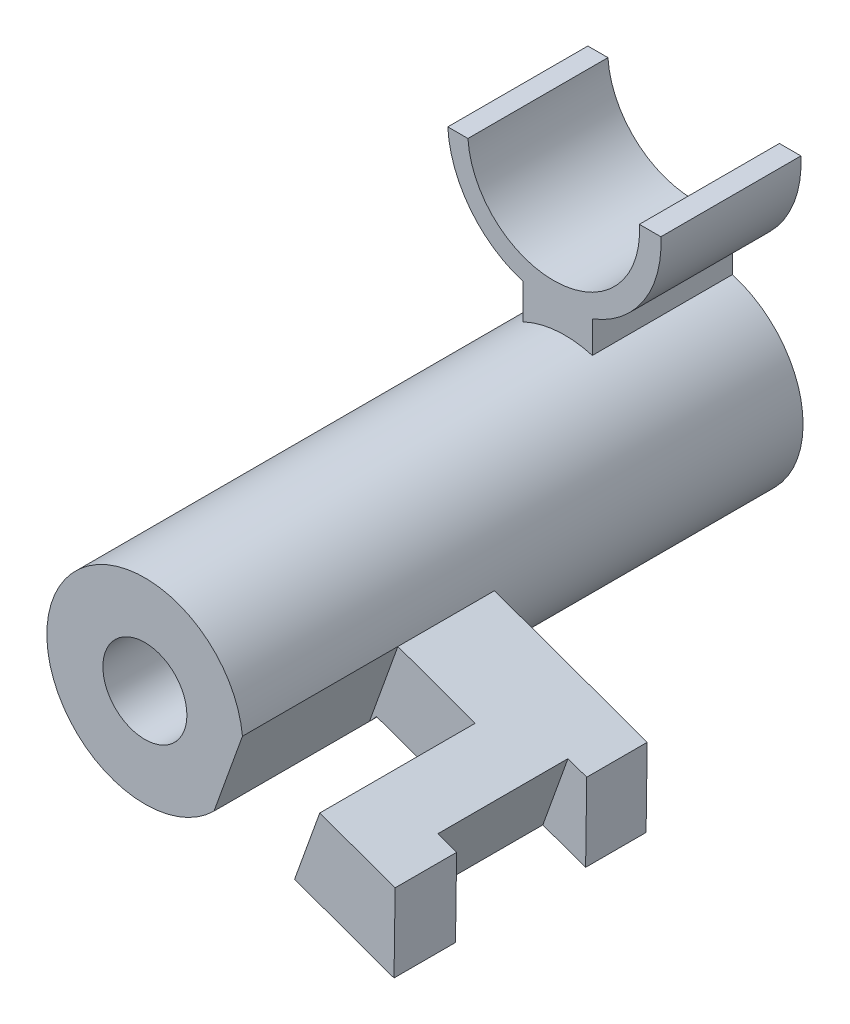
ISO-10303-21;
HEADER;
FILE_DESCRIPTION(('STEP AP214'),'2;1');
FILE_NAME('part.step','',(''),(''),'','','');
FILE_SCHEMA(('AUTOMOTIVE_DESIGN { 1 0 10303 214 1 1 1 1 }'));
ENDSEC;
DATA;
#1=APPLICATION_CONTEXT('core data for automotive mechanical design processes');
#2=APPLICATION_PROTOCOL_DEFINITION('international standard','automotive_design',2000,#1);
#3=PRODUCT_CONTEXT('',#1,'mechanical');
#4=PRODUCT('Part','Part','',(#3));
#5=PRODUCT_RELATED_PRODUCT_CATEGORY('part','',(#4));
#6=PRODUCT_DEFINITION_FORMATION('','',#4);
#7=PRODUCT_DEFINITION_CONTEXT('part definition',#1,'design');
#8=PRODUCT_DEFINITION('design','',#6,#7);
#9=PRODUCT_DEFINITION_SHAPE('','',#8);
#10=(LENGTH_UNIT() NAMED_UNIT(*) SI_UNIT(.MILLI.,.METRE.));
#11=(NAMED_UNIT(*) PLANE_ANGLE_UNIT() SI_UNIT($,.RADIAN.));
#12=(NAMED_UNIT(*) SI_UNIT($,.STERADIAN.) SOLID_ANGLE_UNIT());
#13=UNCERTAINTY_MEASURE_WITH_UNIT(LENGTH_MEASURE(1.E-05),#10,'distance_accuracy_value','');
#14=(GEOMETRIC_REPRESENTATION_CONTEXT(3) GLOBAL_UNCERTAINTY_ASSIGNED_CONTEXT((#13)) GLOBAL_UNIT_ASSIGNED_CONTEXT((#10,
#11,#12)) REPRESENTATION_CONTEXT('',''));
#15=CARTESIAN_POINT('',(0.,0.,0.));
#16=DIRECTION('',(0.,0.,1.));
#17=DIRECTION('',(1.,0.,0.));
#18=AXIS2_PLACEMENT_3D('',#15,#16,#17);
#19=CARTESIAN_POINT('',(-29.1148266125845,50.9476848886692,-100.));
#20=DIRECTION('',(0.,0.,1.));
#21=DIRECTION('',(1.,0.,0.));
#22=AXIS2_PLACEMENT_3D('',#19,#20,#21);
#23=CYLINDRICAL_SURFACE('',#22,17.5);
#24=DIRECTION('',(0.,0.,1.));
#25=VECTOR('',#24,1.);
#26=CARTESIAN_POINT('',(-16.775176631666,38.5386946659146,-100.));
#27=LINE('',#26,#25);
#28=CARTESIAN_POINT('',(-16.775176631666,38.5386946659146,0.));
#29=VERTEX_POINT('',#28);
#30=CARTESIAN_POINT('',(-16.775176631666,38.5386946659146,-27.7524799411566));
#31=VERTEX_POINT('',#30);
#32=EDGE_CURVE('E273',#29,#31,#27,.F.);
#33=ORIENTED_EDGE('',*,*,#32,.F.);
#34=CARTESIAN_POINT('',(-29.1148266125845,50.9476848886692,0.));
#35=DIRECTION('',(0.,0.,1.));
#36=DIRECTION('',(1.,0.,0.));
#37=AXIS2_PLACEMENT_3D('',#34,#35,#36);
#38=CIRCLE('',#37,17.5);
#39=CARTESIAN_POINT('',(-11.6981486491467,52.6533603319769,0.));
#40=VERTEX_POINT('',#39);
#41=EDGE_CURVE('E311',#40,#29,#38,.T.);
#42=ORIENTED_EDGE('',*,*,#41,.F.);
#43=DIRECTION('',(0.,0.,1.));
#44=VECTOR('',#43,1.);
#45=CARTESIAN_POINT('',(-11.6981486491467,52.6533603319769,0.));
#46=LINE('',#45,#44);
#47=CARTESIAN_POINT('',(-11.6981486491467,52.6533603319769,-27.7524799411566));
#48=VERTEX_POINT('',#47);
#49=EDGE_CURVE('E250',#48,#40,#46,.T.);
#50=ORIENTED_EDGE('',*,*,#49,.F.);
#51=DIRECTION('',(0.,0.,1.));
#52=VECTOR('',#51,1.);
#53=CARTESIAN_POINT('',(-11.6981486491467,52.6533603319769,-45.));
#54=LINE('',#53,#52);
#55=CARTESIAN_POINT('',(-11.6981486491467,52.6533603319769,-45.));
#56=VERTEX_POINT('',#55);
#57=EDGE_CURVE('E302',#56,#48,#54,.T.);
#58=ORIENTED_EDGE('',*,*,#57,.F.);
#59=CARTESIAN_POINT('',(-29.1148266125845,50.9476848886692,-45.));
#60=DIRECTION('',(0.,0.,1.));
#61=DIRECTION('',(1.,0.,0.));
#62=AXIS2_PLACEMENT_3D('',#59,#60,#61);
#63=CIRCLE('',#62,17.5);
#64=CARTESIAN_POINT('',(-15.5292414598357,39.9167340657612,-45.));
#65=VERTEX_POINT('',#64);
#66=EDGE_CURVE('E42',#56,#65,#63,.F.);
#67=ORIENTED_EDGE('',*,*,#66,.T.);
#68=DIRECTION('',(0.,0.,1.));
#69=VECTOR('',#68,1.);
#70=CARTESIAN_POINT('',(-15.5292414598357,39.9167340657612,-45.));
#71=LINE('',#70,#69);
#72=CARTESIAN_POINT('',(-15.5292414598357,39.9167340657612,-27.7524799411566));
#73=VERTEX_POINT('',#72);
#74=EDGE_CURVE('E299',#65,#73,#71,.T.);
#75=ORIENTED_EDGE('',*,*,#74,.T.);
#76=CARTESIAN_POINT('',(-29.1148266125845,50.9476848886692,-27.7524799411566));
#77=DIRECTION('',(0.,0.,-1.));
#78=DIRECTION('',(-1.,0.,0.));
#79=AXIS2_PLACEMENT_3D('',#76,#77,#78);
#80=CIRCLE('',#79,17.5);
#81=EDGE_CURVE('E271',#31,#73,#80,.F.);
#82=ORIENTED_EDGE('',*,*,#81,.F.);
#83=EDGE_LOOP('',(#33,#42,#50,#58,#67,#75,#82));
#84=FACE_BOUND('',#83,.T.);
#85=CARTESIAN_POINT('',(-29.1148266125845,50.9476848886692,-75.));
#86=DIRECTION('',(0.,0.,-1.));
#87=DIRECTION('',(-1.,0.,0.));
#88=AXIS2_PLACEMENT_3D('',#85,#86,#87);
#89=CIRCLE('',#88,17.5);
#90=CARTESIAN_POINT('',(-36.589403127859,66.7711075878612,-75.));
#91=VERTEX_POINT('',#90);
#92=CARTESIAN_POINT('',(-24.2356590013951,67.753746992027,-75.));
#93=VERTEX_POINT('',#92);
#94=EDGE_CURVE('E49',#91,#93,#89,.T.);
#95=ORIENTED_EDGE('',*,*,#94,.F.);
#96=DIRECTION('',(0.,0.,-1.));
#97=VECTOR('',#96,1.);
#98=CARTESIAN_POINT('',(-36.589403127859,66.7711075878612,-75.));
#99=LINE('',#98,#97);
#100=CARTESIAN_POINT('',(-36.589403127859,66.7711075878612,-100.));
#101=VERTEX_POINT('',#100);
#102=EDGE_CURVE('E226',#91,#101,#99,.T.);
#103=ORIENTED_EDGE('',*,*,#102,.T.);
#104=CARTESIAN_POINT('',(-29.1148266125845,50.9476848886692,-100.));
#105=DIRECTION('',(0.,0.,1.));
#106=DIRECTION('',(1.,0.,0.));
#107=AXIS2_PLACEMENT_3D('',#104,#105,#106);
#108=CIRCLE('',#107,17.5);
#109=CARTESIAN_POINT('',(-24.2356590013951,67.753746992027,-100.));
#110=VERTEX_POINT('',#109);
#111=EDGE_CURVE('E314',#101,#110,#108,.T.);
#112=ORIENTED_EDGE('',*,*,#111,.T.);
#113=DIRECTION('',(0.,0.,-1.));
#114=VECTOR('',#113,1.);
#115=CARTESIAN_POINT('',(-24.2356590013951,67.753746992027,-75.));
#116=LINE('',#115,#114);
#117=EDGE_CURVE('E54',#93,#110,#116,.T.);
#118=ORIENTED_EDGE('',*,*,#117,.F.);
#119=EDGE_LOOP('',(#95,#103,#112,#118));
#120=FACE_BOUND('',#119,.T.);
#121=ADVANCED_FACE('F35',(#84,#120),#23,.T.);
#122=CARTESIAN_POINT('',(15.5591041955267,42.8489598103443,-45.));
#123=DIRECTION('',(0.999899341143809,-0.0141882902485532,0.));
#124=DIRECTION('',(0.0141882902485532,0.999899341143809,0.));
#125=AXIS2_PLACEMENT_3D('',#122,#123,#124);
#126=PLANE('',#125);
#127=DIRECTION('',(0.0141882902485532,0.999899341143809,0.));
#128=VECTOR('',#127,1.);
#129=CARTESIAN_POINT('',(15.5591041955267,42.8489598103443,-34.2038472972816));
#130=LINE('',#129,#128);
#131=CARTESIAN_POINT('',(15.359838120935,28.8059699076763,-34.2038472972816));
#132=VERTEX_POINT('',#131);
#133=CARTESIAN_POINT('',(15.5591041955267,42.8489598103444,-34.2038472972816));
#134=VERTEX_POINT('',#133);
#135=EDGE_CURVE('E246',#132,#134,#130,.T.);
#136=ORIENTED_EDGE('',*,*,#135,.F.);
#137=DIRECTION('',(0.,0.,1.));
#138=VECTOR('',#137,1.);
#139=CARTESIAN_POINT('',(15.359838120935,28.8059699076762,-45.));
#140=LINE('',#139,#138);
#141=CARTESIAN_POINT('',(15.359838120935,28.8059699076762,-45.));
#142=VERTEX_POINT('',#141);
#143=EDGE_CURVE('E294',#142,#132,#140,.T.);
#144=ORIENTED_EDGE('',*,*,#143,.F.);
#145=DIRECTION('',(0.0141882902485532,0.999899341143809,0.));
#146=VECTOR('',#145,1.);
#147=CARTESIAN_POINT('',(15.5591041955267,42.8489598103443,-45.));
#148=LINE('',#147,#146);
#149=CARTESIAN_POINT('',(15.5591041955267,42.8489598103443,-45.));
#150=VERTEX_POINT('',#149);
#151=EDGE_CURVE('E276',#142,#150,#148,.T.);
#152=ORIENTED_EDGE('',*,*,#151,.T.);
#153=DIRECTION('',(0.,0.,1.));
#154=VECTOR('',#153,1.);
#155=CARTESIAN_POINT('',(15.5591041955267,42.8489598103443,-45.));
#156=LINE('',#155,#154);
#157=EDGE_CURVE('E305',#150,#134,#156,.T.);
#158=ORIENTED_EDGE('',*,*,#157,.T.);
#159=EDGE_LOOP('',(#136,#144,#152,#158));
#160=FACE_BOUND('',#159,.T.);
#161=ADVANCED_FACE('F335',(#160),#126,.T.);
#162=CARTESIAN_POINT('',(-29.1148266125845,50.9476848886692,0.));
#163=DIRECTION('',(0.,0.,1.));
#164=DIRECTION('',(1.,0.,0.));
#165=AXIS2_PLACEMENT_3D('',#162,#163,#164);
#166=PLANE('',#165);
#167=DIRECTION('',(0.33846853216795,0.940977711070817,0.));
#168=VECTOR('',#167,1.);
#169=CARTESIAN_POINT('',(-26.9292325967045,10.3093633337902,0.));
#170=LINE('',#169,#168);
#171=EDGE_CURVE('E258',#29,#40,#170,.T.);
#172=ORIENTED_EDGE('',*,*,#171,.T.);
#173=ORIENTED_EDGE('',*,*,#41,.T.);
#174=EDGE_LOOP('',(#172,#173));
#175=FACE_BOUND('',#174,.T.);
#176=CARTESIAN_POINT('',(-29.1148266125845,50.9476848886692,0.));
#177=DIRECTION('',(0.,0.,1.));
#178=DIRECTION('',(1.,0.,0.));
#179=AXIS2_PLACEMENT_3D('',#176,#177,#178);
#180=CIRCLE('',#179,7.5);
#181=CARTESIAN_POINT('',(-21.6148266125845,50.9476848886692,0.));
#182=VERTEX_POINT('',#181);
#183=EDGE_CURVE('E297',#182,#182,#180,.T.);
#184=ORIENTED_EDGE('',*,*,#183,.F.);
#185=EDGE_LOOP('',(#184));
#186=FACE_BOUND('',#185,.T.);
#187=ADVANCED_FACE('F355',(#175,#186),#166,.T.);
#188=CARTESIAN_POINT('',(-29.1148266125845,50.9476848886692,-100.));
#189=DIRECTION('',(0.,0.,1.));
#190=DIRECTION('',(1.,0.,0.));
#191=AXIS2_PLACEMENT_3D('',#188,#189,#190);
#192=PLANE('',#191);
#193=CARTESIAN_POINT('',(-29.1148266125845,50.9476848886692,-100.));
#194=DIRECTION('',(0.,0.,1.));
#195=DIRECTION('',(1.,0.,0.));
#196=AXIS2_PLACEMENT_3D('',#193,#194,#195);
#197=CIRCLE('',#196,7.5);
#198=CARTESIAN_POINT('',(-21.6148266125845,50.9476848886692,-100.));
#199=VERTEX_POINT('',#198);
#200=EDGE_CURVE('E308',#199,#199,#197,.T.);
#201=ORIENTED_EDGE('',*,*,#200,.T.);
#202=EDGE_LOOP('',(#201));
#203=FACE_BOUND('',#202,.T.);
#204=ORIENTED_EDGE('',*,*,#111,.F.);
#205=DIRECTION('',(0.,-1.,0.));
#206=VECTOR('',#205,1.);
#207=CARTESIAN_POINT('',(-36.589403127859,0.,-100.));
#208=LINE('',#207,#206);
#209=CARTESIAN_POINT('',(-36.589403127859,72.9987783409454,-100.));
#210=VERTEX_POINT('',#209);
#211=EDGE_CURVE('E217',#210,#101,#208,.T.);
#212=ORIENTED_EDGE('',*,*,#211,.F.);
#213=CARTESIAN_POINT('',(-31.0187177659695,91.2116636441969,-100.));
#214=DIRECTION('',(0.,0.,-1.));
#215=DIRECTION('',(-1.,0.,0.));
#216=AXIS2_PLACEMENT_3D('',#213,#214,#215);
#217=CIRCLE('',#216,19.0457797548581);
#218=CARTESIAN_POINT('',(-50.0374355319391,90.1967247253656,-100.));
#219=VERTEX_POINT('',#218);
#220=EDGE_CURVE('E196',#210,#219,#217,.T.);
#221=ORIENTED_EDGE('',*,*,#220,.T.);
#222=DIRECTION('',(-1.,0.,0.));
#223=VECTOR('',#222,1.);
#224=CARTESIAN_POINT('',(0.,90.1967247253656,-100.));
#225=LINE('',#224,#223);
#226=CARTESIAN_POINT('',(-46.4461132037667,90.1967247253656,-100.));
#227=VERTEX_POINT('',#226);
#228=EDGE_CURVE('E193',#227,#219,#225,.T.);
#229=ORIENTED_EDGE('',*,*,#228,.F.);
#230=CARTESIAN_POINT('',(-31.1439571967711,91.2116636441969,-100.));
#231=DIRECTION('',(0.,0.,-1.));
#232=DIRECTION('',(-1.,0.,0.));
#233=AXIS2_PLACEMENT_3D('',#230,#231,#232);
#234=CIRCLE('',#233,15.3357777589332);
#235=CARTESIAN_POINT('',(-15.8418011897754,92.2266025630283,-100.));
#236=VERTEX_POINT('',#235);
#237=EDGE_CURVE('E208',#236,#227,#234,.T.);
#238=ORIENTED_EDGE('',*,*,#237,.F.);
#239=DIRECTION('',(-1.,0.,0.));
#240=VECTOR('',#239,1.);
#241=CARTESIAN_POINT('',(0.,92.2266025630283,-100.));
#242=LINE('',#241,#240);
#243=CARTESIAN_POINT('',(-12.,92.2266025630283,-100.));
#244=VERTEX_POINT('',#243);
#245=EDGE_CURVE('E183',#244,#236,#242,.T.);
#246=ORIENTED_EDGE('',*,*,#245,.F.);
#247=CARTESIAN_POINT('',(-24.2356590013951,73.4147020982786,-100.));
#248=VERTEX_POINT('',#247);
#249=EDGE_CURVE('E211',#244,#248,#217,.T.);
#250=ORIENTED_EDGE('',*,*,#249,.T.);
#251=DIRECTION('',(0.,-1.,0.));
#252=VECTOR('',#251,1.);
#253=CARTESIAN_POINT('',(-24.2356590013951,0.,-100.));
#254=LINE('',#253,#252);
#255=EDGE_CURVE('E214',#248,#110,#254,.T.);
#256=ORIENTED_EDGE('',*,*,#255,.T.);
#257=EDGE_LOOP('',(#204,#212,#221,#229,#238,#246,#250,#256));
#258=FACE_BOUND('',#257,.T.);
#259=ADVANCED_FACE('F358',(#203,#258),#192,.F.);
#260=DIRECTION('',(0.33846853216795,0.940977711070817,0.));
#261=VECTOR('',#260,1.);
#262=CARTESIAN_POINT('',(-13.1276764989206,5.3449604801513,0.));
#263=LINE('',#262,#261);
#264=CARTESIAN_POINT('',(-2.39199139889896,35.1912812813499,0.));
#265=VERTEX_POINT('',#264);
#266=CARTESIAN_POINT('',(2.10340744863714,47.688957478338,0.));
#267=VERTEX_POINT('',#266);
#268=EDGE_CURVE('E264',#265,#267,#263,.T.);
#269=ORIENTED_EDGE('',*,*,#268,.F.);
#270=DIRECTION('',(0.940977711070817,-0.33846853216795,0.));
#271=VECTOR('',#270,1.);
#272=CARTESIAN_POINT('',(-15.5292414598357,39.9167340657612,0.));
#273=LINE('',#272,#271);
#274=CARTESIAN_POINT('',(15.359838120935,28.8059699076762,0.));
#275=VERTEX_POINT('',#274);
#276=EDGE_CURVE('E280',#265,#275,#273,.T.);
#277=ORIENTED_EDGE('',*,*,#276,.T.);
#278=DIRECTION('',(0.0141882902485532,0.999899341143809,0.));
#279=VECTOR('',#278,1.);
#280=CARTESIAN_POINT('',(15.5591041955267,42.8489598103443,0.));
#281=LINE('',#280,#279);
#282=CARTESIAN_POINT('',(15.5591041955267,42.8489598103443,0.));
#283=VERTEX_POINT('',#282);
#284=EDGE_CURVE('E275',#275,#283,#281,.T.);
#285=ORIENTED_EDGE('',*,*,#284,.T.);
#286=DIRECTION('',(-0.940977711070817,0.33846853216795,0.));
#287=VECTOR('',#286,1.);
#288=CARTESIAN_POINT('',(-11.6981486491467,52.6533603319769,0.));
#289=LINE('',#288,#287);
#290=EDGE_CURVE('E289',#283,#267,#289,.T.);
#291=ORIENTED_EDGE('',*,*,#290,.T.);
#292=EDGE_LOOP('',(#269,#277,#285,#291));
#293=FACE_BOUND('',#292,.T.);
#294=ADVANCED_FACE('F359',(#293),#166,.T.);
#295=CARTESIAN_POINT('',(-29.1148266125845,50.9476848886692,-100.));
#296=DIRECTION('',(0.,0.,1.));
#297=DIRECTION('',(1.,0.,0.));
#298=AXIS2_PLACEMENT_3D('',#295,#296,#297);
#299=CYLINDRICAL_SURFACE('',#298,7.5);
#300=ORIENTED_EDGE('',*,*,#200,.F.);
#301=EDGE_LOOP('',(#300));
#302=FACE_BOUND('',#301,.T.);
#303=ORIENTED_EDGE('',*,*,#183,.T.);
#304=EDGE_LOOP('',(#303));
#305=FACE_BOUND('',#304,.T.);
#306=ADVANCED_FACE('F362',(#302,#305),#299,.F.);
#307=DIRECTION('',(-0.0141882902485532,-0.999899341143809,0.));
#308=VECTOR('',#307,1.);
#309=CARTESIAN_POINT('',(15.5591041955267,42.8489598103443,-10.9758652624466));
#310=LINE('',#309,#308);
#311=CARTESIAN_POINT('',(15.5591041955267,42.8489598103444,-10.9758652624466));
#312=VERTEX_POINT('',#311);
#313=CARTESIAN_POINT('',(15.359838120935,28.8059699076763,-10.9758652624466));
#314=VERTEX_POINT('',#313);
#315=EDGE_CURVE('E242',#312,#314,#310,.T.);
#316=ORIENTED_EDGE('',*,*,#315,.F.);
#317=EDGE_CURVE('E286',#312,#283,#156,.T.);
#318=ORIENTED_EDGE('',*,*,#317,.T.);
#319=ORIENTED_EDGE('',*,*,#284,.F.);
#320=EDGE_CURVE('E298',#314,#275,#140,.T.);
#321=ORIENTED_EDGE('',*,*,#320,.F.);
#322=EDGE_LOOP('',(#316,#318,#319,#321));
#323=FACE_BOUND('',#322,.T.);
#324=ADVANCED_FACE('F364',(#323),#126,.T.);
#325=CARTESIAN_POINT('',(-15.5292414598357,39.9167340657612,-45.));
#326=DIRECTION('',(-0.33846853216795,-0.940977711070817,0.));
#327=DIRECTION('',(0.940977711070817,-0.33846853216795,0.));
#328=AXIS2_PLACEMENT_3D('',#325,#326,#327);
#329=PLANE('',#328);
#330=DIRECTION('',(0.940977711070817,-0.33846853216795,0.));
#331=VECTOR('',#330,1.);
#332=CARTESIAN_POINT('',(-15.5292414598357,39.9167340657612,-34.2038472972816));
#333=LINE('',#332,#331);
#334=CARTESIAN_POINT('',(7.72160650784135,31.5534324798775,-34.2038472972816));
#335=VERTEX_POINT('',#334);
#336=EDGE_CURVE('E244',#335,#132,#333,.T.);
#337=ORIENTED_EDGE('',*,*,#336,.F.);
#338=DIRECTION('',(0.,0.,-1.));
#339=VECTOR('',#338,1.);
#340=CARTESIAN_POINT('',(7.72160650784134,31.5534324798775,-45.));
#341=LINE('',#340,#339);
#342=CARTESIAN_POINT('',(7.72160650784135,31.5534324798775,-10.9758652624466));
#343=VERTEX_POINT('',#342);
#344=EDGE_CURVE('E248',#343,#335,#341,.T.);
#345=ORIENTED_EDGE('',*,*,#344,.F.);
#346=DIRECTION('',(-0.940977711070817,0.33846853216795,0.));
#347=VECTOR('',#346,1.);
#348=CARTESIAN_POINT('',(-15.5292414598357,39.9167340657612,-10.9758652624466));
#349=LINE('',#348,#347);
#350=EDGE_CURVE('E238',#314,#343,#349,.T.);
#351=ORIENTED_EDGE('',*,*,#350,.F.);
#352=ORIENTED_EDGE('',*,*,#320,.T.);
#353=ORIENTED_EDGE('',*,*,#276,.F.);
#354=DIRECTION('',(0.,0.,1.));
#355=VECTOR('',#354,1.);
#356=CARTESIAN_POINT('',(-2.39199139889896,35.1912812813499,-45.));
#357=LINE('',#356,#355);
#358=CARTESIAN_POINT('',(-2.39199139889896,35.1912812813499,-27.7524799411566));
#359=VERTEX_POINT('',#358);
#360=EDGE_CURVE('E261',#359,#265,#357,.T.);
#361=ORIENTED_EDGE('',*,*,#360,.F.);
#362=DIRECTION('',(0.940977711070817,-0.33846853216795,0.));
#363=VECTOR('',#362,1.);
#364=CARTESIAN_POINT('',(-15.5292414598357,39.9167340657612,-27.7524799411566));
#365=LINE('',#364,#363);
#366=EDGE_CURVE('E269',#73,#359,#365,.T.);
#367=ORIENTED_EDGE('',*,*,#366,.F.);
#368=ORIENTED_EDGE('',*,*,#74,.F.);
#369=DIRECTION('',(0.940977711070817,-0.33846853216795,0.));
#370=VECTOR('',#369,1.);
#371=CARTESIAN_POINT('',(-15.5292414598357,39.9167340657612,-45.));
#372=LINE('',#371,#370);
#373=EDGE_CURVE('E283',#65,#142,#372,.T.);
#374=ORIENTED_EDGE('',*,*,#373,.T.);
#375=ORIENTED_EDGE('',*,*,#143,.T.);
#376=EDGE_LOOP('',(#337,#345,#351,#352,#353,#361,#367,#368,#374,#375));
#377=FACE_BOUND('',#376,.T.);
#378=ADVANCED_FACE('F338',(#377),#329,.T.);
#379=CARTESIAN_POINT('',(-11.6981486491467,52.6533603319769,-45.));
#380=DIRECTION('',(0.33846853216795,0.940977711070817,0.));
#381=DIRECTION('',(-0.940977711070817,0.33846853216795,0.));
#382=AXIS2_PLACEMENT_3D('',#379,#380,#381);
#383=PLANE('',#382);
#384=DIRECTION('',(-0.940977711070817,0.33846853216795,0.));
#385=VECTOR('',#384,1.);
#386=CARTESIAN_POINT('',(-11.6981486491467,52.6533603319769,-34.2038472972816));
#387=LINE('',#386,#385);
#388=CARTESIAN_POINT('',(12.2170053553774,44.0511086768656,-34.2038472972816));
#389=VERTEX_POINT('',#388);
#390=EDGE_CURVE('E11',#134,#389,#387,.T.);
#391=ORIENTED_EDGE('',*,*,#390,.F.);
#392=ORIENTED_EDGE('',*,*,#157,.F.);
#393=DIRECTION('',(-0.940977711070817,0.33846853216795,0.));
#394=VECTOR('',#393,1.);
#395=CARTESIAN_POINT('',(-11.6981486491467,52.6533603319769,-45.));
#396=LINE('',#395,#394);
#397=EDGE_CURVE('E279',#150,#56,#396,.T.);
#398=ORIENTED_EDGE('',*,*,#397,.T.);
#399=ORIENTED_EDGE('',*,*,#57,.T.);
#400=DIRECTION('',(-0.940977711070817,0.33846853216795,0.));
#401=VECTOR('',#400,1.);
#402=CARTESIAN_POINT('',(-11.6981486491467,52.6533603319769,-27.7524799411566));
#403=LINE('',#402,#401);
#404=CARTESIAN_POINT('',(2.10340744863714,47.688957478338,-27.7524799411566));
#405=VERTEX_POINT('',#404);
#406=EDGE_CURVE('E255',#405,#48,#403,.T.);
#407=ORIENTED_EDGE('',*,*,#406,.F.);
#408=DIRECTION('',(0.,0.,-1.));
#409=VECTOR('',#408,1.);
#410=CARTESIAN_POINT('',(2.10340744863714,47.688957478338,0.));
#411=LINE('',#410,#409);
#412=EDGE_CURVE('E252',#267,#405,#411,.T.);
#413=ORIENTED_EDGE('',*,*,#412,.F.);
#414=ORIENTED_EDGE('',*,*,#290,.F.);
#415=ORIENTED_EDGE('',*,*,#317,.F.);
#416=DIRECTION('',(0.940977711070817,-0.33846853216795,0.));
#417=VECTOR('',#416,1.);
#418=CARTESIAN_POINT('',(12.2170053553774,44.0511086768656,-10.9758652624466));
#419=LINE('',#418,#417);
#420=CARTESIAN_POINT('',(12.2170053553773,44.0511086768656,-10.9758652624466));
#421=VERTEX_POINT('',#420);
#422=EDGE_CURVE('E233',#421,#312,#419,.T.);
#423=ORIENTED_EDGE('',*,*,#422,.F.);
#424=DIRECTION('',(0.,0.,1.));
#425=VECTOR('',#424,1.);
#426=CARTESIAN_POINT('',(12.2170053553774,44.0511086768656,-10.9758652624466));
#427=LINE('',#426,#425);
#428=EDGE_CURVE('E221',#389,#421,#427,.T.);
#429=ORIENTED_EDGE('',*,*,#428,.F.);
#430=EDGE_LOOP('',(#391,#392,#398,#399,#407,#413,#414,#415,#423,#429));
#431=FACE_BOUND('',#430,.T.);
#432=ADVANCED_FACE('F330',(#431),#383,.T.);
#433=CARTESIAN_POINT('',(0.,0.,-45.));
#434=DIRECTION('',(0.,0.,1.));
#435=DIRECTION('',(1.,0.,0.));
#436=AXIS2_PLACEMENT_3D('',#433,#434,#435);
#437=PLANE('',#436);
#438=ORIENTED_EDGE('',*,*,#66,.F.);
#439=ORIENTED_EDGE('',*,*,#397,.F.);
#440=ORIENTED_EDGE('',*,*,#151,.F.);
#441=ORIENTED_EDGE('',*,*,#373,.F.);
#442=EDGE_LOOP('',(#438,#439,#440,#441));
#443=FACE_BOUND('',#442,.T.);
#444=ADVANCED_FACE('F326',(#443),#437,.F.);
#445=CARTESIAN_POINT('',(-26.9292325967045,10.3093633337902,0.));
#446=DIRECTION('',(-0.940977711070817,0.33846853216795,0.));
#447=DIRECTION('',(-0.33846853216795,-0.940977711070817,0.));
#448=AXIS2_PLACEMENT_3D('',#445,#446,#447);
#449=PLANE('',#448);
#450=ORIENTED_EDGE('',*,*,#32,.T.);
#451=DIRECTION('',(0.33846853216795,0.940977711070817,0.));
#452=VECTOR('',#451,1.);
#453=CARTESIAN_POINT('',(-26.9292325967045,10.3093633337902,-27.7524799411566));
#454=LINE('',#453,#452);
#455=EDGE_CURVE('E259',#31,#48,#454,.T.);
#456=ORIENTED_EDGE('',*,*,#455,.T.);
#457=ORIENTED_EDGE('',*,*,#49,.T.);
#458=ORIENTED_EDGE('',*,*,#171,.F.);
#459=EDGE_LOOP('',(#450,#456,#457,#458));
#460=FACE_BOUND('',#459,.T.);
#461=ADVANCED_FACE('F353',(#460),#449,.F.);
#462=CARTESIAN_POINT('',(-26.9292325967045,10.3093633337902,-27.7524799411566));
#463=DIRECTION('',(0.,0.,-1.));
#464=DIRECTION('',(-1.,0.,0.));
#465=AXIS2_PLACEMENT_3D('',#462,#463,#464);
#466=PLANE('',#465);
#467=ORIENTED_EDGE('',*,*,#81,.T.);
#468=ORIENTED_EDGE('',*,*,#366,.T.);
#469=DIRECTION('',(0.33846853216795,0.940977711070817,0.));
#470=VECTOR('',#469,1.);
#471=CARTESIAN_POINT('',(-13.1276764989206,5.3449604801513,-27.7524799411566));
#472=LINE('',#471,#470);
#473=EDGE_CURVE('E262',#359,#405,#472,.T.);
#474=ORIENTED_EDGE('',*,*,#473,.T.);
#475=ORIENTED_EDGE('',*,*,#406,.T.);
#476=ORIENTED_EDGE('',*,*,#455,.F.);
#477=EDGE_LOOP('',(#467,#468,#474,#475,#476));
#478=FACE_BOUND('',#477,.T.);
#479=ADVANCED_FACE('F344',(#478),#466,.F.);
#480=CARTESIAN_POINT('',(-13.1276764989206,5.3449604801513,0.));
#481=DIRECTION('',(0.940977711070817,-0.33846853216795,0.));
#482=DIRECTION('',(0.33846853216795,0.940977711070817,0.));
#483=AXIS2_PLACEMENT_3D('',#480,#481,#482);
#484=PLANE('',#483);
#485=ORIENTED_EDGE('',*,*,#360,.T.);
#486=ORIENTED_EDGE('',*,*,#268,.T.);
#487=ORIENTED_EDGE('',*,*,#412,.T.);
#488=ORIENTED_EDGE('',*,*,#473,.F.);
#489=EDGE_LOOP('',(#485,#486,#487,#488));
#490=FACE_BOUND('',#489,.T.);
#491=ADVANCED_FACE('F347',(#490),#484,.F.);
#492=CARTESIAN_POINT('',(-3.01407859218033,1.70711167867885,-10.9758652624466));
#493=DIRECTION('',(-0.940977711070817,0.33846853216795,0.));
#494=DIRECTION('',(-0.33846853216795,-0.940977711070817,0.));
#495=AXIS2_PLACEMENT_3D('',#492,#493,#494);
#496=PLANE('',#495);
#497=ORIENTED_EDGE('',*,*,#344,.T.);
#498=DIRECTION('',(0.33846853216795,0.940977711070817,0.));
#499=VECTOR('',#498,1.);
#500=CARTESIAN_POINT('',(-3.01407859218033,1.70711167867885,-34.2038472972816));
#501=LINE('',#500,#499);
#502=EDGE_CURVE('E236',#335,#389,#501,.T.);
#503=ORIENTED_EDGE('',*,*,#502,.T.);
#504=ORIENTED_EDGE('',*,*,#428,.T.);
#505=DIRECTION('',(0.33846853216795,0.940977711070817,0.));
#506=VECTOR('',#505,1.);
#507=CARTESIAN_POINT('',(-3.01407859218033,1.70711167867885,-10.9758652624466));
#508=LINE('',#507,#506);
#509=EDGE_CURVE('E235',#343,#421,#508,.T.);
#510=ORIENTED_EDGE('',*,*,#509,.F.);
#511=EDGE_LOOP('',(#497,#503,#504,#510));
#512=FACE_BOUND('',#511,.T.);
#513=ADVANCED_FACE('F393',(#512),#496,.F.);
#514=CARTESIAN_POINT('',(-3.01407859218033,1.70711167867885,-34.2038472972816));
#515=DIRECTION('',(0.,0.,-1.));
#516=DIRECTION('',(-1.,0.,0.));
#517=AXIS2_PLACEMENT_3D('',#514,#515,#516);
#518=PLANE('',#517);
#519=ORIENTED_EDGE('',*,*,#135,.T.);
#520=ORIENTED_EDGE('',*,*,#390,.T.);
#521=ORIENTED_EDGE('',*,*,#502,.F.);
#522=ORIENTED_EDGE('',*,*,#336,.T.);
#523=EDGE_LOOP('',(#519,#520,#521,#522));
#524=FACE_BOUND('',#523,.T.);
#525=ADVANCED_FACE('F398',(#524),#518,.F.);
#526=CARTESIAN_POINT('',(-3.01407859218033,1.70711167867885,-10.9758652624466));
#527=DIRECTION('',(0.,0.,1.));
#528=DIRECTION('',(1.,0.,0.));
#529=AXIS2_PLACEMENT_3D('',#526,#527,#528);
#530=PLANE('',#529);
#531=ORIENTED_EDGE('',*,*,#315,.T.);
#532=ORIENTED_EDGE('',*,*,#350,.T.);
#533=ORIENTED_EDGE('',*,*,#509,.T.);
#534=ORIENTED_EDGE('',*,*,#422,.T.);
#535=EDGE_LOOP('',(#531,#532,#533,#534));
#536=FACE_BOUND('',#535,.T.);
#537=ADVANCED_FACE('F400',(#536),#530,.F.);
#538=CARTESIAN_POINT('',(-31.1439571967711,91.2116636441969,-75.));
#539=DIRECTION('',(0.,0.,-1.));
#540=DIRECTION('',(-1.,0.,0.));
#541=AXIS2_PLACEMENT_3D('',#538,#539,#540);
#542=CYLINDRICAL_SURFACE('',#541,15.3357777589332);
#543=ORIENTED_EDGE('',*,*,#237,.T.);
#544=DIRECTION('',(0.,0.,-1.));
#545=VECTOR('',#544,1.);
#546=CARTESIAN_POINT('',(-46.4461132037667,90.1967247253656,-75.));
#547=LINE('',#546,#545);
#548=CARTESIAN_POINT('',(-46.4461132037667,90.1967247253656,-75.));
#549=VERTEX_POINT('',#548);
#550=EDGE_CURVE('E192',#549,#227,#547,.T.);
#551=ORIENTED_EDGE('',*,*,#550,.F.);
#552=CARTESIAN_POINT('',(-31.1439571967711,91.2116636441969,-75.));
#553=DIRECTION('',(0.,0.,-1.));
#554=DIRECTION('',(-1.,0.,0.));
#555=AXIS2_PLACEMENT_3D('',#552,#553,#554);
#556=CIRCLE('',#555,15.3357777589332);
#557=CARTESIAN_POINT('',(-15.8418011897754,92.2266025630283,-75.));
#558=VERTEX_POINT('',#557);
#559=EDGE_CURVE('E172',#558,#549,#556,.T.);
#560=ORIENTED_EDGE('',*,*,#559,.F.);
#561=DIRECTION('',(0.,0.,-1.));
#562=VECTOR('',#561,1.);
#563=CARTESIAN_POINT('',(-15.8418011897754,92.2266025630283,-75.));
#564=LINE('',#563,#562);
#565=EDGE_CURVE('E180',#558,#236,#564,.T.);
#566=ORIENTED_EDGE('',*,*,#565,.T.);
#567=EDGE_LOOP('',(#543,#551,#560,#566));
#568=FACE_BOUND('',#567,.T.);
#569=ADVANCED_FACE('F190',(#568),#542,.F.);
#570=CARTESIAN_POINT('',(0.,90.1967247253656,-75.));
#571=DIRECTION('',(0.,-1.,0.));
#572=DIRECTION('',(0.,0.,-1.));
#573=AXIS2_PLACEMENT_3D('',#570,#571,#572);
#574=PLANE('',#573);
#575=ORIENTED_EDGE('',*,*,#228,.T.);
#576=DIRECTION('',(0.,0.,-1.));
#577=VECTOR('',#576,1.);
#578=CARTESIAN_POINT('',(-50.0374355319391,90.1967247253656,-75.));
#579=LINE('',#578,#577);
#580=CARTESIAN_POINT('',(-50.0374355319391,90.1967247253656,-75.));
#581=VERTEX_POINT('',#580);
#582=EDGE_CURVE('E222',#581,#219,#579,.T.);
#583=ORIENTED_EDGE('',*,*,#582,.F.);
#584=DIRECTION('',(-1.,0.,0.));
#585=VECTOR('',#584,1.);
#586=CARTESIAN_POINT('',(0.,90.1967247253656,-75.));
#587=LINE('',#586,#585);
#588=EDGE_CURVE('E188',#549,#581,#587,.T.);
#589=ORIENTED_EDGE('',*,*,#588,.F.);
#590=ORIENTED_EDGE('',*,*,#550,.T.);
#591=EDGE_LOOP('',(#575,#583,#589,#590));
#592=FACE_BOUND('',#591,.T.);
#593=ADVANCED_FACE('F409',(#592),#574,.F.);
#594=CARTESIAN_POINT('',(-31.0187177659695,91.2116636441969,-75.));
#595=DIRECTION('',(0.,0.,-1.));
#596=DIRECTION('',(-1.,0.,0.));
#597=AXIS2_PLACEMENT_3D('',#594,#595,#596);
#598=CYLINDRICAL_SURFACE('',#597,19.0457797548581);
#599=ORIENTED_EDGE('',*,*,#220,.F.);
#600=DIRECTION('',(0.,0.,-1.));
#601=VECTOR('',#600,1.);
#602=CARTESIAN_POINT('',(-36.589403127859,72.9987783409454,-75.));
#603=LINE('',#602,#601);
#604=CARTESIAN_POINT('',(-36.589403127859,72.9987783409454,-75.));
#605=VERTEX_POINT('',#604);
#606=EDGE_CURVE('E224',#605,#210,#603,.T.);
#607=ORIENTED_EDGE('',*,*,#606,.F.);
#608=CARTESIAN_POINT('',(-31.0187177659695,91.2116636441969,-75.));
#609=DIRECTION('',(0.,0.,-1.));
#610=DIRECTION('',(-1.,0.,0.));
#611=AXIS2_PLACEMENT_3D('',#608,#609,#610);
#612=CIRCLE('',#611,19.0457797548581);
#613=EDGE_CURVE('E201',#605,#581,#612,.T.);
#614=ORIENTED_EDGE('',*,*,#613,.T.);
#615=ORIENTED_EDGE('',*,*,#582,.T.);
#616=EDGE_LOOP('',(#599,#607,#614,#615));
#617=FACE_BOUND('',#616,.T.);
#618=ADVANCED_FACE('F420',(#617),#598,.T.);
#619=CARTESIAN_POINT('',(-36.589403127859,0.,-75.));
#620=DIRECTION('',(1.,0.,0.));
#621=DIRECTION('',(0.,0.,-1.));
#622=AXIS2_PLACEMENT_3D('',#619,#620,#621);
#623=PLANE('',#622);
#624=ORIENTED_EDGE('',*,*,#211,.T.);
#625=ORIENTED_EDGE('',*,*,#102,.F.);
#626=DIRECTION('',(0.,-1.,0.));
#627=VECTOR('',#626,1.);
#628=CARTESIAN_POINT('',(-36.589403127859,0.,-75.));
#629=LINE('',#628,#627);
#630=EDGE_CURVE('E205',#605,#91,#629,.T.);
#631=ORIENTED_EDGE('',*,*,#630,.F.);
#632=ORIENTED_EDGE('',*,*,#606,.T.);
#633=EDGE_LOOP('',(#624,#625,#631,#632));
#634=FACE_BOUND('',#633,.T.);
#635=ADVANCED_FACE('F416',(#634),#623,.F.);
#636=CARTESIAN_POINT('',(-24.2356590013951,0.,-75.));
#637=DIRECTION('',(1.,0.,0.));
#638=DIRECTION('',(0.,0.,-1.));
#639=AXIS2_PLACEMENT_3D('',#636,#637,#638);
#640=PLANE('',#639);
#641=ORIENTED_EDGE('',*,*,#255,.F.);
#642=DIRECTION('',(0.,0.,-1.));
#643=VECTOR('',#642,1.);
#644=CARTESIAN_POINT('',(-24.2356590013951,73.4147020982786,-75.));
#645=LINE('',#644,#643);
#646=CARTESIAN_POINT('',(-24.2356590013951,73.4147020982786,-75.));
#647=VERTEX_POINT('',#646);
#648=EDGE_CURVE('E229',#647,#248,#645,.T.);
#649=ORIENTED_EDGE('',*,*,#648,.F.);
#650=DIRECTION('',(0.,-1.,0.));
#651=VECTOR('',#650,1.);
#652=CARTESIAN_POINT('',(-24.2356590013951,0.,-75.));
#653=LINE('',#652,#651);
#654=EDGE_CURVE('E200',#647,#93,#653,.T.);
#655=ORIENTED_EDGE('',*,*,#654,.T.);
#656=ORIENTED_EDGE('',*,*,#117,.T.);
#657=EDGE_LOOP('',(#641,#649,#655,#656));
#658=FACE_BOUND('',#657,.T.);
#659=ADVANCED_FACE('F413',(#658),#640,.T.);
#660=ORIENTED_EDGE('',*,*,#249,.F.);
#661=DIRECTION('',(0.,0.,-1.));
#662=VECTOR('',#661,1.);
#663=CARTESIAN_POINT('',(-12.,92.2266025630283,-75.));
#664=LINE('',#663,#662);
#665=CARTESIAN_POINT('',(-12.,92.2266025630283,-75.));
#666=VERTEX_POINT('',#665);
#667=EDGE_CURVE('E187',#666,#244,#664,.T.);
#668=ORIENTED_EDGE('',*,*,#667,.F.);
#669=EDGE_CURVE('E176',#666,#647,#612,.T.);
#670=ORIENTED_EDGE('',*,*,#669,.T.);
#671=ORIENTED_EDGE('',*,*,#648,.T.);
#672=EDGE_LOOP('',(#660,#668,#670,#671));
#673=FACE_BOUND('',#672,.T.);
#674=ADVANCED_FACE('F412',(#673),#598,.T.);
#675=CARTESIAN_POINT('',(0.,92.2266025630283,-75.));
#676=DIRECTION('',(0.,-1.,0.));
#677=DIRECTION('',(0.,0.,-1.));
#678=AXIS2_PLACEMENT_3D('',#675,#676,#677);
#679=PLANE('',#678);
#680=ORIENTED_EDGE('',*,*,#245,.T.);
#681=ORIENTED_EDGE('',*,*,#565,.F.);
#682=DIRECTION('',(-1.,0.,0.));
#683=VECTOR('',#682,1.);
#684=CARTESIAN_POINT('',(0.,92.2266025630283,-75.));
#685=LINE('',#684,#683);
#686=EDGE_CURVE('E168',#666,#558,#685,.T.);
#687=ORIENTED_EDGE('',*,*,#686,.F.);
#688=ORIENTED_EDGE('',*,*,#667,.T.);
#689=EDGE_LOOP('',(#680,#681,#687,#688));
#690=FACE_BOUND('',#689,.T.);
#691=ADVANCED_FACE('F181',(#690),#679,.F.);
#692=CARTESIAN_POINT('',(0.,0.,-75.));
#693=DIRECTION('',(0.,0.,-1.));
#694=DIRECTION('',(-1.,0.,0.));
#695=AXIS2_PLACEMENT_3D('',#692,#693,#694);
#696=PLANE('',#695);
#697=ORIENTED_EDGE('',*,*,#559,.T.);
#698=ORIENTED_EDGE('',*,*,#588,.T.);
#699=ORIENTED_EDGE('',*,*,#613,.F.);
#700=ORIENTED_EDGE('',*,*,#630,.T.);
#701=ORIENTED_EDGE('',*,*,#94,.T.);
#702=ORIENTED_EDGE('',*,*,#654,.F.);
#703=ORIENTED_EDGE('',*,*,#669,.F.);
#704=ORIENTED_EDGE('',*,*,#686,.T.);
#705=EDGE_LOOP('',(#697,#698,#699,#700,#701,#702,#703,#704));
#706=FACE_BOUND('',#705,.T.);
#707=ADVANCED_FACE('F170',(#706),#696,.F.);
#708=CLOSED_SHELL('',(#121,#161,#187,#259,#294,#306,#324,#378,#432,#444,#461,#479,#491,#513,
#525,#537,#569,#593,#618,#635,#659,#674,#691,#707));
#709=MANIFOLD_SOLID_BREP('B2',#708);
#710=ADVANCED_BREP_SHAPE_REPRESENTATION('',(#18,#709),#14);
#711=SHAPE_DEFINITION_REPRESENTATION(#9,#710);
ENDSEC;
END-ISO-10303-21;
